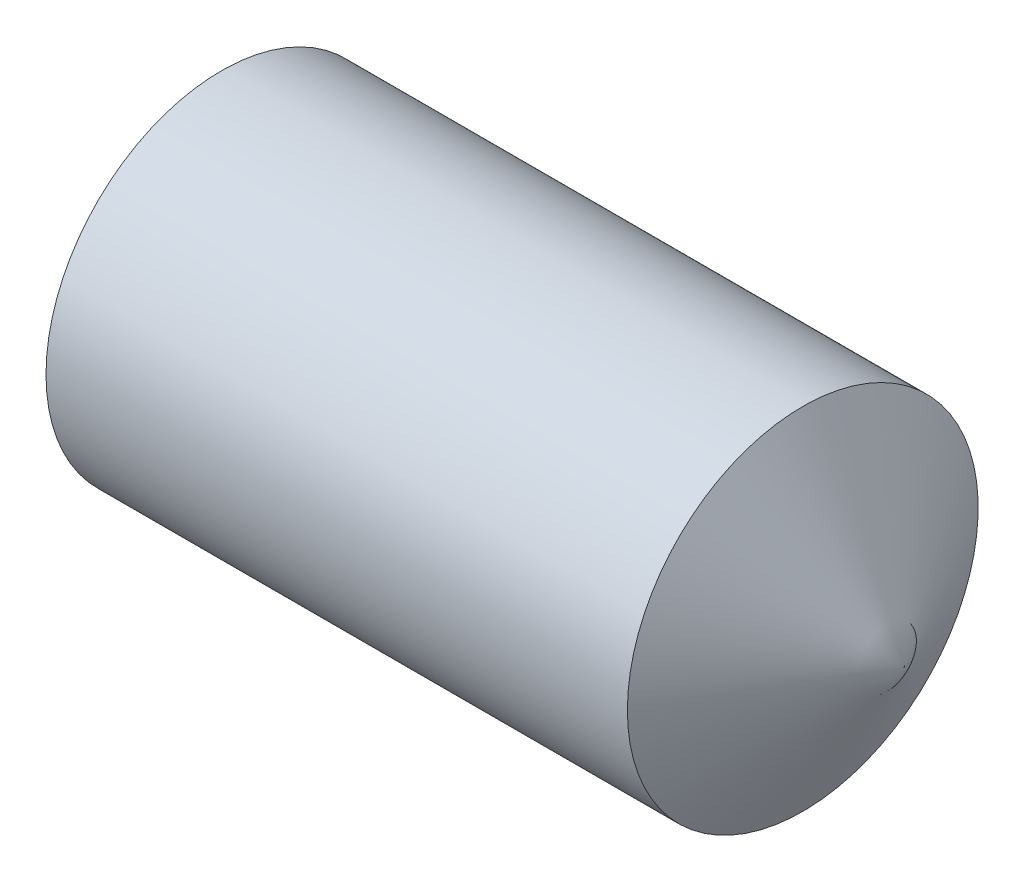
ISO-10303-21;
HEADER;
FILE_DESCRIPTION(('STEP AP214'),'2;1');
FILE_NAME('part.step','',(''),(''),'','','');
FILE_SCHEMA(('AUTOMOTIVE_DESIGN { 1 0 10303 214 1 1 1 1 }'));
ENDSEC;
DATA;
#1=APPLICATION_CONTEXT('core data for automotive mechanical design processes');
#2=APPLICATION_PROTOCOL_DEFINITION('international standard','automotive_design',2000,#1);
#3=PRODUCT_CONTEXT('',#1,'mechanical');
#4=PRODUCT('Part','Part','',(#3));
#5=PRODUCT_RELATED_PRODUCT_CATEGORY('part','',(#4));
#6=PRODUCT_DEFINITION_FORMATION('','',#4);
#7=PRODUCT_DEFINITION_CONTEXT('part definition',#1,'design');
#8=PRODUCT_DEFINITION('design','',#6,#7);
#9=PRODUCT_DEFINITION_SHAPE('','',#8);
#10=(LENGTH_UNIT() NAMED_UNIT(*) SI_UNIT(.MILLI.,.METRE.));
#11=(NAMED_UNIT(*) PLANE_ANGLE_UNIT() SI_UNIT($,.RADIAN.));
#12=(NAMED_UNIT(*) SI_UNIT($,.STERADIAN.) SOLID_ANGLE_UNIT());
#13=UNCERTAINTY_MEASURE_WITH_UNIT(LENGTH_MEASURE(1.E-05),#10,'distance_accuracy_value','');
#14=(GEOMETRIC_REPRESENTATION_CONTEXT(3) GLOBAL_UNCERTAINTY_ASSIGNED_CONTEXT((#13)) GLOBAL_UNIT_ASSIGNED_CONTEXT((#10,
#11,#12)) REPRESENTATION_CONTEXT('',''));
#15=CARTESIAN_POINT('',(0.,0.,0.));
#16=DIRECTION('',(0.,0.,1.));
#17=DIRECTION('',(1.,0.,0.));
#18=AXIS2_PLACEMENT_3D('',#15,#16,#17);
#19=CARTESIAN_POINT('',(0.,0.,0.));
#20=DIRECTION('',(-1.,0.,0.));
#21=DIRECTION('',(0.,0.,1.));
#22=AXIS2_PLACEMENT_3D('',#19,#20,#21);
#23=PLANE('',#22);
#24=CARTESIAN_POINT('',(0.,0.,0.));
#25=DIRECTION('',(-1.,0.,0.));
#26=DIRECTION('',(0.,0.,1.));
#27=AXIS2_PLACEMENT_3D('',#24,#25,#26);
#28=CIRCLE('',#27,1.2195);
#29=CARTESIAN_POINT('',(0.,0.,1.2195));
#30=VERTEX_POINT('',#29);
#31=EDGE_CURVE('E11',#30,#30,#28,.T.);
#32=ORIENTED_EDGE('',*,*,#31,.T.);
#33=EDGE_LOOP('',(#32));
#34=FACE_BOUND('',#33,.T.);
#35=DIRECTION('',(0.,0.,-1.));
#36=VECTOR('',#35,1.);
#37=CARTESIAN_POINT('',(0.,0.750000000000003,0.433012701892216));
#38=LINE('',#37,#36);
#39=CARTESIAN_POINT('',(0.,0.750000000000003,0.433012701892216));
#40=VERTEX_POINT('',#39);
#41=CARTESIAN_POINT('',(0.,0.750000000000003,-0.433012701892222));
#42=VERTEX_POINT('',#41);
#43=EDGE_CURVE('E96',#40,#42,#38,.T.);
#44=ORIENTED_EDGE('',*,*,#43,.F.);
#45=DIRECTION('',(0.,-0.866025403784439,0.5));
#46=VECTOR('',#45,1.);
#47=CARTESIAN_POINT('',(0.,0.750000000000003,0.433012701892216));
#48=LINE('',#47,#46);
#49=CARTESIAN_POINT('',(0.,0.,0.866025403784435));
#50=VERTEX_POINT('',#49);
#51=EDGE_CURVE('E49',#40,#50,#48,.T.);
#52=ORIENTED_EDGE('',*,*,#51,.T.);
#53=DIRECTION('',(0.,0.866025403784439,0.5));
#54=VECTOR('',#53,1.);
#55=CARTESIAN_POINT('',(0.,-0.749999999999996,0.433012701892216));
#56=LINE('',#55,#54);
#57=CARTESIAN_POINT('',(0.,-0.749999999999996,0.433012701892216));
#58=VERTEX_POINT('',#57);
#59=EDGE_CURVE('E102',#58,#50,#56,.T.);
#60=ORIENTED_EDGE('',*,*,#59,.F.);
#61=DIRECTION('',(0.,0.,-1.));
#62=VECTOR('',#61,1.);
#63=CARTESIAN_POINT('',(0.,-0.749999999999996,0.433012701892216));
#64=LINE('',#63,#62);
#65=CARTESIAN_POINT('',(0.,-0.749999999999996,-0.433012701892222));
#66=VERTEX_POINT('',#65);
#67=EDGE_CURVE('E122',#58,#66,#64,.T.);
#68=ORIENTED_EDGE('',*,*,#67,.T.);
#69=DIRECTION('',(0.,0.866025403784438,-0.500000000000001));
#70=VECTOR('',#69,1.);
#71=CARTESIAN_POINT('',(0.,-0.749999999999996,-0.433012701892222));
#72=LINE('',#71,#70);
#73=CARTESIAN_POINT('',(0.,0.,-0.866025403784441));
#74=VERTEX_POINT('',#73);
#75=EDGE_CURVE('E125',#66,#74,#72,.T.);
#76=ORIENTED_EDGE('',*,*,#75,.T.);
#77=DIRECTION('',(0.,-0.866025403784439,-0.5));
#78=VECTOR('',#77,1.);
#79=CARTESIAN_POINT('',(0.,0.750000000000003,-0.433012701892222));
#80=LINE('',#79,#78);
#81=EDGE_CURVE('E128',#42,#74,#80,.T.);
#82=ORIENTED_EDGE('',*,*,#81,.F.);
#83=EDGE_LOOP('',(#44,#52,#60,#68,#76,#82));
#84=FACE_BOUND('',#83,.T.);
#85=ADVANCED_FACE('F35',(#34,#84),#23,.T.);
#86=CARTESIAN_POINT('',(0.,0.,0.));
#87=DIRECTION('',(1.,0.,0.));
#88=DIRECTION('',(0.,0.,-1.));
#89=AXIS2_PLACEMENT_3D('',#86,#87,#88);
#90=CONICAL_SURFACE('',#89,1.2195,1.0471975511966);
#91=CARTESIAN_POINT('',(0.161946750507689,0.,0.));
#92=DIRECTION('',(-1.,0.,0.));
#93=DIRECTION('',(0.,0.,1.));
#94=AXIS2_PLACEMENT_3D('',#91,#92,#93);
#95=CIRCLE('',#94,1.5);
#96=CARTESIAN_POINT('',(0.161946750507689,0.,1.5));
#97=VERTEX_POINT('',#96);
#98=EDGE_CURVE('E42',#97,#97,#95,.T.);
#99=ORIENTED_EDGE('',*,*,#98,.T.);
#100=EDGE_LOOP('',(#99));
#101=FACE_BOUND('',#100,.T.);
#102=ORIENTED_EDGE('',*,*,#31,.F.);
#103=EDGE_LOOP('',(#102));
#104=FACE_BOUND('',#103,.T.);
#105=ADVANCED_FACE('F145',(#101,#104),#90,.T.);
#106=CARTESIAN_POINT('',(-12.7,0.,0.));
#107=DIRECTION('',(-1.,0.,0.));
#108=DIRECTION('',(0.,0.,1.));
#109=AXIS2_PLACEMENT_3D('',#106,#107,#108);
#110=CYLINDRICAL_SURFACE('',#109,1.5);
#111=CARTESIAN_POINT('',(5.13397459621557,0.,0.));
#112=DIRECTION('',(-1.,0.,0.));
#113=DIRECTION('',(0.,0.,1.));
#114=AXIS2_PLACEMENT_3D('',#111,#112,#113);
#115=CIRCLE('',#114,1.5);
#116=CARTESIAN_POINT('',(5.13397459621557,0.,1.5));
#117=VERTEX_POINT('',#116);
#118=EDGE_CURVE('E103',#117,#117,#115,.T.);
#119=ORIENTED_EDGE('',*,*,#118,.T.);
#120=EDGE_LOOP('',(#119));
#121=FACE_BOUND('',#120,.T.);
#122=ORIENTED_EDGE('',*,*,#98,.F.);
#123=EDGE_LOOP('',(#122));
#124=FACE_BOUND('',#123,.T.);
#125=ADVANCED_FACE('F148',(#121,#124),#110,.T.);
#126=CARTESIAN_POINT('',(5.13397459621557,0.,0.));
#127=DIRECTION('',(-1.,0.,0.));
#128=DIRECTION('',(0.,0.,1.));
#129=AXIS2_PLACEMENT_3D('',#126,#127,#128);
#130=CONICAL_SURFACE('',#129,1.5,1.0471975511966);
#131=CARTESIAN_POINT('',(6.,0.,0.));
#132=VERTEX_POINT('',#131);
#133=VERTEX_LOOP('',#132);
#134=FACE_BOUND('',#133,.T.);
#135=ORIENTED_EDGE('',*,*,#118,.F.);
#136=EDGE_LOOP('',(#135));
#137=FACE_BOUND('',#136,.T.);
#138=ADVANCED_FACE('F150',(#134,#137),#130,.T.);
#139=CARTESIAN_POINT('',(1.2,0.750000000000003,0.433012701892216));
#140=DIRECTION('',(0.,-0.5,-0.866025403784438));
#141=DIRECTION('',(0.,0.866025403784438,-0.5));
#142=AXIS2_PLACEMENT_3D('',#139,#140,#141);
#143=PLANE('',#142);
#144=ORIENTED_EDGE('',*,*,#51,.F.);
#145=DIRECTION('',(-1.,0.,0.));
#146=VECTOR('',#145,1.);
#147=CARTESIAN_POINT('',(1.2,0.750000000000003,0.433012701892216));
#148=LINE('',#147,#146);
#149=CARTESIAN_POINT('',(1.2,0.750000000000003,0.433012701892216));
#150=VERTEX_POINT('',#149);
#151=EDGE_CURVE('E90',#150,#40,#148,.T.);
#152=ORIENTED_EDGE('',*,*,#151,.F.);
#153=DIRECTION('',(0.,-0.866025403784439,0.5));
#154=VECTOR('',#153,1.);
#155=CARTESIAN_POINT('',(1.2,0.750000000000003,0.433012701892216));
#156=LINE('',#155,#154);
#157=CARTESIAN_POINT('',(1.2,0.,0.866025403784435));
#158=VERTEX_POINT('',#157);
#159=EDGE_CURVE('E85',#150,#158,#156,.T.);
#160=ORIENTED_EDGE('',*,*,#159,.T.);
#161=DIRECTION('',(-1.,0.,0.));
#162=VECTOR('',#161,1.);
#163=CARTESIAN_POINT('',(1.2,0.,0.866025403784435));
#164=LINE('',#163,#162);
#165=EDGE_CURVE('E88',#158,#50,#164,.T.);
#166=ORIENTED_EDGE('',*,*,#165,.T.);
#167=EDGE_LOOP('',(#144,#152,#160,#166));
#168=FACE_BOUND('',#167,.T.);
#169=ADVANCED_FACE('F87',(#168),#143,.T.);
#170=CARTESIAN_POINT('',(1.2,-0.749999999999996,0.433012701892216));
#171=DIRECTION('',(0.,-0.5,0.866025403784439));
#172=DIRECTION('',(0.,-0.866025403784439,-0.5));
#173=AXIS2_PLACEMENT_3D('',#170,#171,#172);
#174=PLANE('',#173);
#175=ORIENTED_EDGE('',*,*,#59,.T.);
#176=ORIENTED_EDGE('',*,*,#165,.F.);
#177=DIRECTION('',(0.,0.866025403784439,0.5));
#178=VECTOR('',#177,1.);
#179=CARTESIAN_POINT('',(1.2,-0.749999999999996,0.433012701892216));
#180=LINE('',#179,#178);
#181=CARTESIAN_POINT('',(1.2,-0.749999999999996,0.433012701892216));
#182=VERTEX_POINT('',#181);
#183=EDGE_CURVE('E95',#182,#158,#180,.T.);
#184=ORIENTED_EDGE('',*,*,#183,.F.);
#185=DIRECTION('',(-1.,0.,0.));
#186=VECTOR('',#185,1.);
#187=CARTESIAN_POINT('',(1.2,-0.749999999999996,0.433012701892216));
#188=LINE('',#187,#186);
#189=EDGE_CURVE('E104',#182,#58,#188,.T.);
#190=ORIENTED_EDGE('',*,*,#189,.T.);
#191=EDGE_LOOP('',(#175,#176,#184,#190));
#192=FACE_BOUND('',#191,.T.);
#193=ADVANCED_FACE('F100',(#192),#174,.F.);
#194=CARTESIAN_POINT('',(1.2,-0.749999999999996,0.433012701892216));
#195=DIRECTION('',(0.,1.,0.));
#196=DIRECTION('',(0.,0.,1.));
#197=AXIS2_PLACEMENT_3D('',#194,#195,#196);
#198=PLANE('',#197);
#199=ORIENTED_EDGE('',*,*,#67,.F.);
#200=ORIENTED_EDGE('',*,*,#189,.F.);
#201=DIRECTION('',(0.,0.,-1.));
#202=VECTOR('',#201,1.);
#203=CARTESIAN_POINT('',(1.2,-0.749999999999996,0.433012701892216));
#204=LINE('',#203,#202);
#205=CARTESIAN_POINT('',(1.2,-0.749999999999996,-0.433012701892222));
#206=VERTEX_POINT('',#205);
#207=EDGE_CURVE('E109',#182,#206,#204,.T.);
#208=ORIENTED_EDGE('',*,*,#207,.T.);
#209=DIRECTION('',(-1.,0.,0.));
#210=VECTOR('',#209,1.);
#211=CARTESIAN_POINT('',(1.2,-0.749999999999996,-0.433012701892222));
#212=LINE('',#211,#210);
#213=EDGE_CURVE('E138',#206,#66,#212,.T.);
#214=ORIENTED_EDGE('',*,*,#213,.T.);
#215=EDGE_LOOP('',(#199,#200,#208,#214));
#216=FACE_BOUND('',#215,.T.);
#217=ADVANCED_FACE('F178',(#216),#198,.T.);
#218=CARTESIAN_POINT('',(1.2,-0.749999999999996,-0.433012701892222));
#219=DIRECTION('',(0.,0.500000000000001,0.866025403784438));
#220=DIRECTION('',(0.,-0.866025403784438,0.500000000000001));
#221=AXIS2_PLACEMENT_3D('',#218,#219,#220);
#222=PLANE('',#221);
#223=ORIENTED_EDGE('',*,*,#75,.F.);
#224=ORIENTED_EDGE('',*,*,#213,.F.);
#225=DIRECTION('',(0.,0.866025403784438,-0.500000000000001));
#226=VECTOR('',#225,1.);
#227=CARTESIAN_POINT('',(1.2,-0.749999999999996,-0.433012701892222));
#228=LINE('',#227,#226);
#229=CARTESIAN_POINT('',(1.2,0.,-0.866025403784441));
#230=VERTEX_POINT('',#229);
#231=EDGE_CURVE('E111',#206,#230,#228,.T.);
#232=ORIENTED_EDGE('',*,*,#231,.T.);
#233=DIRECTION('',(-1.,0.,0.));
#234=VECTOR('',#233,1.);
#235=CARTESIAN_POINT('',(1.2,0.,-0.866025403784441));
#236=LINE('',#235,#234);
#237=EDGE_CURVE('E136',#230,#74,#236,.T.);
#238=ORIENTED_EDGE('',*,*,#237,.T.);
#239=EDGE_LOOP('',(#223,#224,#232,#238));
#240=FACE_BOUND('',#239,.T.);
#241=ADVANCED_FACE('F174',(#240),#222,.T.);
#242=CARTESIAN_POINT('',(1.2,0.750000000000003,-0.433012701892222));
#243=DIRECTION('',(0.,0.5,-0.866025403784439));
#244=DIRECTION('',(0.,0.866025403784439,0.5));
#245=AXIS2_PLACEMENT_3D('',#242,#243,#244);
#246=PLANE('',#245);
#247=ORIENTED_EDGE('',*,*,#81,.T.);
#248=ORIENTED_EDGE('',*,*,#237,.F.);
#249=DIRECTION('',(0.,-0.866025403784439,-0.5));
#250=VECTOR('',#249,1.);
#251=CARTESIAN_POINT('',(1.2,0.750000000000003,-0.433012701892222));
#252=LINE('',#251,#250);
#253=CARTESIAN_POINT('',(1.2,0.750000000000003,-0.433012701892222));
#254=VERTEX_POINT('',#253);
#255=EDGE_CURVE('E115',#254,#230,#252,.T.);
#256=ORIENTED_EDGE('',*,*,#255,.F.);
#257=DIRECTION('',(-1.,0.,0.));
#258=VECTOR('',#257,1.);
#259=CARTESIAN_POINT('',(1.2,0.750000000000003,-0.433012701892222));
#260=LINE('',#259,#258);
#261=EDGE_CURVE('E134',#254,#42,#260,.T.);
#262=ORIENTED_EDGE('',*,*,#261,.T.);
#263=EDGE_LOOP('',(#247,#248,#256,#262));
#264=FACE_BOUND('',#263,.T.);
#265=ADVANCED_FACE('F171',(#264),#246,.F.);
#266=CARTESIAN_POINT('',(1.2,0.750000000000003,0.433012701892216));
#267=DIRECTION('',(0.,1.,0.));
#268=DIRECTION('',(0.,0.,1.));
#269=AXIS2_PLACEMENT_3D('',#266,#267,#268);
#270=PLANE('',#269);
#271=ORIENTED_EDGE('',*,*,#43,.T.);
#272=ORIENTED_EDGE('',*,*,#261,.F.);
#273=DIRECTION('',(0.,0.,-1.));
#274=VECTOR('',#273,1.);
#275=CARTESIAN_POINT('',(1.2,0.750000000000003,0.433012701892216));
#276=LINE('',#275,#274);
#277=EDGE_CURVE('E118',#150,#254,#276,.T.);
#278=ORIENTED_EDGE('',*,*,#277,.F.);
#279=ORIENTED_EDGE('',*,*,#151,.T.);
#280=EDGE_LOOP('',(#271,#272,#278,#279));
#281=FACE_BOUND('',#280,.T.);
#282=ADVANCED_FACE('F167',(#281),#270,.F.);
#283=CARTESIAN_POINT('',(1.2,1.5,0.));
#284=DIRECTION('',(1.,0.,0.));
#285=DIRECTION('',(0.,0.,-1.));
#286=AXIS2_PLACEMENT_3D('',#283,#284,#285);
#287=PLANE('',#286);
#288=ORIENTED_EDGE('',*,*,#159,.F.);
#289=ORIENTED_EDGE('',*,*,#277,.T.);
#290=ORIENTED_EDGE('',*,*,#255,.T.);
#291=ORIENTED_EDGE('',*,*,#231,.F.);
#292=ORIENTED_EDGE('',*,*,#207,.F.);
#293=ORIENTED_EDGE('',*,*,#183,.T.);
#294=EDGE_LOOP('',(#288,#289,#290,#291,#292,#293));
#295=FACE_BOUND('',#294,.T.);
#296=ADVANCED_FACE('F107',(#295),#287,.F.);
#297=CLOSED_SHELL('',(#85,#105,#125,#138,#169,#193,#217,#241,#265,#282,#296));
#298=MANIFOLD_SOLID_BREP('B2',#297);
#299=ADVANCED_BREP_SHAPE_REPRESENTATION('',(#18,#298),#14);
#300=SHAPE_DEFINITION_REPRESENTATION(#9,#299);
ENDSEC;
END-ISO-10303-21;
